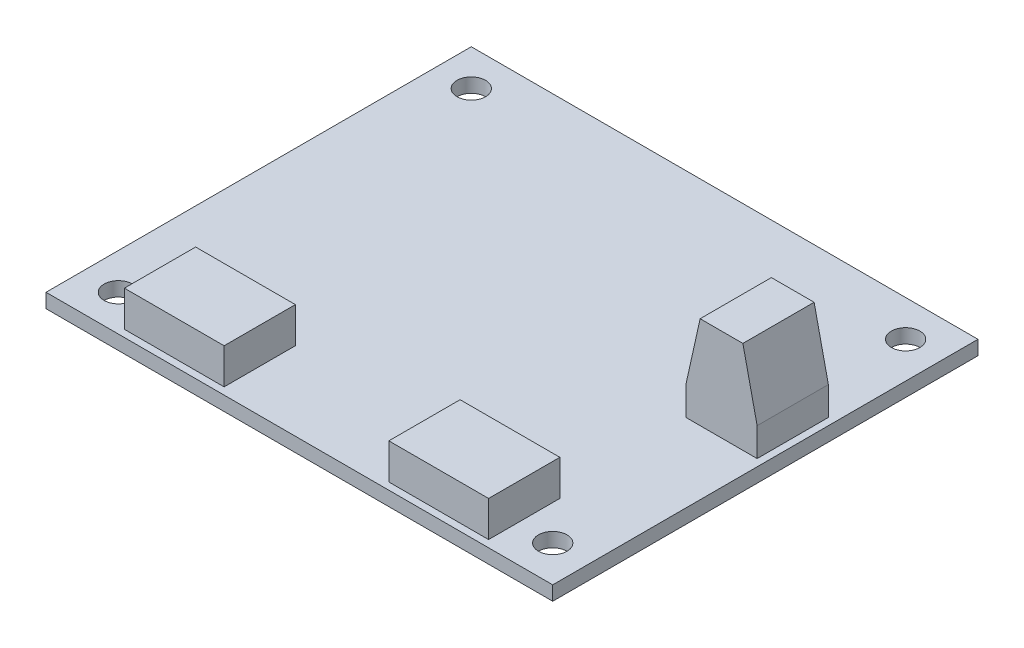
ISO-10303-21;
HEADER;
FILE_DESCRIPTION(('STEP AP214'),'2;1');
FILE_NAME('part.step','',(''),(''),'','','');
FILE_SCHEMA(('AUTOMOTIVE_DESIGN { 1 0 10303 214 1 1 1 1 }'));
ENDSEC;
DATA;
#1=APPLICATION_CONTEXT('core data for automotive mechanical design processes');
#2=APPLICATION_PROTOCOL_DEFINITION('international standard','automotive_design',2000,#1);
#3=PRODUCT_CONTEXT('',#1,'mechanical');
#4=PRODUCT('Part','Part','',(#3));
#5=PRODUCT_RELATED_PRODUCT_CATEGORY('part','',(#4));
#6=PRODUCT_DEFINITION_FORMATION('','',#4);
#7=PRODUCT_DEFINITION_CONTEXT('part definition',#1,'design');
#8=PRODUCT_DEFINITION('design','',#6,#7);
#9=PRODUCT_DEFINITION_SHAPE('','',#8);
#10=(LENGTH_UNIT() NAMED_UNIT(*) SI_UNIT(.MILLI.,.METRE.));
#11=(NAMED_UNIT(*) PLANE_ANGLE_UNIT() SI_UNIT($,.RADIAN.));
#12=(NAMED_UNIT(*) SI_UNIT($,.STERADIAN.) SOLID_ANGLE_UNIT());
#13=UNCERTAINTY_MEASURE_WITH_UNIT(LENGTH_MEASURE(1.E-05),#10,'distance_accuracy_value','');
#14=(GEOMETRIC_REPRESENTATION_CONTEXT(3) GLOBAL_UNCERTAINTY_ASSIGNED_CONTEXT((#13)) GLOBAL_UNIT_ASSIGNED_CONTEXT((#10,
#11,#12)) REPRESENTATION_CONTEXT('',''));
#15=CARTESIAN_POINT('',(0.,0.,0.));
#16=DIRECTION('',(0.,0.,1.));
#17=DIRECTION('',(1.,0.,0.));
#18=AXIS2_PLACEMENT_3D('',#15,#16,#17);
#19=CARTESIAN_POINT('',(-35.56,2.,29.845));
#20=DIRECTION('',(0.,1.,0.));
#21=DIRECTION('',(0.,0.,1.));
#22=AXIS2_PLACEMENT_3D('',#19,#20,#21);
#23=PLANE('',#22);
#24=DIRECTION('',(1.,0.,0.));
#25=VECTOR('',#24,1.);
#26=CARTESIAN_POINT('',(11.56,2.,28.845));
#27=LINE('',#26,#25);
#28=CARTESIAN_POINT('',(11.56,2.,28.845));
#29=VERTEX_POINT('',#28);
#30=CARTESIAN_POINT('',(25.56,2.,28.845));
#31=VERTEX_POINT('',#30);
#32=EDGE_CURVE('E212',#29,#31,#27,.T.);
#33=ORIENTED_EDGE('',*,*,#32,.F.);
#34=DIRECTION('',(0.,0.,1.));
#35=VECTOR('',#34,1.);
#36=CARTESIAN_POINT('',(11.56,2.,28.845));
#37=LINE('',#36,#35);
#38=CARTESIAN_POINT('',(11.56,2.,18.845));
#39=VERTEX_POINT('',#38);
#40=EDGE_CURVE('E198',#39,#29,#37,.T.);
#41=ORIENTED_EDGE('',*,*,#40,.F.);
#42=DIRECTION('',(-1.,0.,0.));
#43=VECTOR('',#42,1.);
#44=CARTESIAN_POINT('',(11.56,2.,18.845));
#45=LINE('',#44,#43);
#46=CARTESIAN_POINT('',(25.56,2.,18.845));
#47=VERTEX_POINT('',#46);
#48=EDGE_CURVE('E203',#47,#39,#45,.T.);
#49=ORIENTED_EDGE('',*,*,#48,.F.);
#50=DIRECTION('',(0.,0.,-1.));
#51=VECTOR('',#50,1.);
#52=CARTESIAN_POINT('',(25.56,2.,28.845));
#53=LINE('',#52,#51);
#54=EDGE_CURVE('E214',#31,#47,#53,.T.);
#55=ORIENTED_EDGE('',*,*,#54,.F.);
#56=EDGE_LOOP('',(#33,#41,#49,#55));
#57=FACE_BOUND('',#56,.T.);
#58=DIRECTION('',(0.,0.,1.));
#59=VECTOR('',#58,1.);
#60=CARTESIAN_POINT('',(-35.56,2.,-29.845));
#61=LINE('',#60,#59);
#62=CARTESIAN_POINT('',(-35.56,2.,-29.845));
#63=VERTEX_POINT('',#62);
#64=CARTESIAN_POINT('',(-35.56,2.,29.845));
#65=VERTEX_POINT('',#64);
#66=EDGE_CURVE('E281',#63,#65,#61,.T.);
#67=ORIENTED_EDGE('',*,*,#66,.T.);
#68=DIRECTION('',(1.,0.,0.));
#69=VECTOR('',#68,1.);
#70=CARTESIAN_POINT('',(-35.56,2.,29.845));
#71=LINE('',#70,#69);
#72=CARTESIAN_POINT('',(35.56,2.,29.845));
#73=VERTEX_POINT('',#72);
#74=EDGE_CURVE('E284',#65,#73,#71,.T.);
#75=ORIENTED_EDGE('',*,*,#74,.T.);
#76=DIRECTION('',(0.,0.,-1.));
#77=VECTOR('',#76,1.);
#78=CARTESIAN_POINT('',(35.56,2.,-29.845));
#79=LINE('',#78,#77);
#80=CARTESIAN_POINT('',(35.56,2.,-29.845));
#81=VERTEX_POINT('',#80);
#82=EDGE_CURVE('E287',#73,#81,#79,.T.);
#83=ORIENTED_EDGE('',*,*,#82,.T.);
#84=DIRECTION('',(-1.,0.,0.));
#85=VECTOR('',#84,1.);
#86=CARTESIAN_POINT('',(-35.56,2.,-29.845));
#87=LINE('',#86,#85);
#88=EDGE_CURVE('E289',#81,#63,#87,.T.);
#89=ORIENTED_EDGE('',*,*,#88,.T.);
#90=EDGE_LOOP('',(#67,#75,#83,#89));
#91=FACE_BOUND('',#90,.T.);
#92=CARTESIAN_POINT('',(-30.48,2.,-24.765));
#93=DIRECTION('',(0.,1.,0.));
#94=DIRECTION('',(0.,0.,1.));
#95=AXIS2_PLACEMENT_3D('',#92,#93,#94);
#96=CIRCLE('',#95,2.);
#97=CARTESIAN_POINT('',(-30.48,2.,-22.765));
#98=VERTEX_POINT('',#97);
#99=EDGE_CURVE('E272',#98,#98,#96,.T.);
#100=ORIENTED_EDGE('',*,*,#99,.F.);
#101=EDGE_LOOP('',(#100));
#102=FACE_BOUND('',#101,.T.);
#103=CARTESIAN_POINT('',(30.48,2.,-24.765));
#104=DIRECTION('',(0.,1.,0.));
#105=DIRECTION('',(0.,0.,1.));
#106=AXIS2_PLACEMENT_3D('',#103,#104,#105);
#107=CIRCLE('',#106,2.);
#108=CARTESIAN_POINT('',(30.48,2.,-22.765));
#109=VERTEX_POINT('',#108);
#110=EDGE_CURVE('E266',#109,#109,#107,.T.);
#111=ORIENTED_EDGE('',*,*,#110,.F.);
#112=EDGE_LOOP('',(#111));
#113=FACE_BOUND('',#112,.T.);
#114=CARTESIAN_POINT('',(30.48,2.,24.765));
#115=DIRECTION('',(0.,1.,0.));
#116=DIRECTION('',(0.,0.,1.));
#117=AXIS2_PLACEMENT_3D('',#114,#115,#116);
#118=CIRCLE('',#117,2.);
#119=CARTESIAN_POINT('',(30.48,2.,26.765));
#120=VERTEX_POINT('',#119);
#121=EDGE_CURVE('E260',#120,#120,#118,.T.);
#122=ORIENTED_EDGE('',*,*,#121,.F.);
#123=EDGE_LOOP('',(#122));
#124=FACE_BOUND('',#123,.T.);
#125=CARTESIAN_POINT('',(-30.48,2.,24.765));
#126=DIRECTION('',(0.,1.,0.));
#127=DIRECTION('',(0.,0.,1.));
#128=AXIS2_PLACEMENT_3D('',#125,#126,#127);
#129=CIRCLE('',#128,2.);
#130=CARTESIAN_POINT('',(-30.48,2.,26.765));
#131=VERTEX_POINT('',#130);
#132=EDGE_CURVE('E256',#131,#131,#129,.T.);
#133=ORIENTED_EDGE('',*,*,#132,.F.);
#134=EDGE_LOOP('',(#133));
#135=FACE_BOUND('',#134,.T.);
#136=DIRECTION('',(-1.,0.,0.));
#137=VECTOR('',#136,1.);
#138=CARTESIAN_POINT('',(-11.56,2.,18.845));
#139=LINE('',#138,#137);
#140=CARTESIAN_POINT('',(-11.56,2.,18.845));
#141=VERTEX_POINT('',#140);
#142=CARTESIAN_POINT('',(-25.56,2.,18.845));
#143=VERTEX_POINT('',#142);
#144=EDGE_CURVE('E241',#141,#143,#139,.T.);
#145=ORIENTED_EDGE('',*,*,#144,.F.);
#146=DIRECTION('',(0.,0.,-1.));
#147=VECTOR('',#146,1.);
#148=CARTESIAN_POINT('',(-11.56,2.,28.845));
#149=LINE('',#148,#147);
#150=CARTESIAN_POINT('',(-11.56,2.,28.845));
#151=VERTEX_POINT('',#150);
#152=EDGE_CURVE('E227',#151,#141,#149,.T.);
#153=ORIENTED_EDGE('',*,*,#152,.F.);
#154=DIRECTION('',(1.,0.,0.));
#155=VECTOR('',#154,1.);
#156=CARTESIAN_POINT('',(-11.56,2.,28.845));
#157=LINE('',#156,#155);
#158=CARTESIAN_POINT('',(-25.56,2.,28.845));
#159=VERTEX_POINT('',#158);
#160=EDGE_CURVE('E232',#159,#151,#157,.T.);
#161=ORIENTED_EDGE('',*,*,#160,.F.);
#162=DIRECTION('',(0.,0.,1.));
#163=VECTOR('',#162,1.);
#164=CARTESIAN_POINT('',(-25.56,2.,28.845));
#165=LINE('',#164,#163);
#166=EDGE_CURVE('E243',#143,#159,#165,.T.);
#167=ORIENTED_EDGE('',*,*,#166,.F.);
#168=EDGE_LOOP('',(#145,#153,#161,#167));
#169=FACE_BOUND('',#168,.T.);
#170=DIRECTION('',(1.,0.,0.));
#171=VECTOR('',#170,1.);
#172=CARTESIAN_POINT('',(24.56,2.,0.155000000000002));
#173=LINE('',#172,#171);
#174=CARTESIAN_POINT('',(24.56,2.,0.155000000000002));
#175=VERTEX_POINT('',#174);
#176=CARTESIAN_POINT('',(34.56,2.,0.155000000000002));
#177=VERTEX_POINT('',#176);
#178=EDGE_CURVE('E188',#175,#177,#173,.T.);
#179=ORIENTED_EDGE('',*,*,#178,.F.);
#180=DIRECTION('',(0.,0.,1.));
#181=VECTOR('',#180,1.);
#182=CARTESIAN_POINT('',(24.56,2.,-9.845));
#183=LINE('',#182,#181);
#184=CARTESIAN_POINT('',(24.56,2.,-9.845));
#185=VERTEX_POINT('',#184);
#186=EDGE_CURVE('E185',#185,#175,#183,.T.);
#187=ORIENTED_EDGE('',*,*,#186,.F.);
#188=DIRECTION('',(-1.,0.,0.));
#189=VECTOR('',#188,1.);
#190=CARTESIAN_POINT('',(24.56,2.,-9.845));
#191=LINE('',#190,#189);
#192=CARTESIAN_POINT('',(34.56,2.,-9.845));
#193=VERTEX_POINT('',#192);
#194=EDGE_CURVE('E174',#193,#185,#191,.T.);
#195=ORIENTED_EDGE('',*,*,#194,.F.);
#196=DIRECTION('',(0.,0.,-1.));
#197=VECTOR('',#196,1.);
#198=CARTESIAN_POINT('',(34.56,2.,-9.845));
#199=LINE('',#198,#197);
#200=EDGE_CURVE('E179',#177,#193,#199,.T.);
#201=ORIENTED_EDGE('',*,*,#200,.F.);
#202=EDGE_LOOP('',(#179,#187,#195,#201));
#203=FACE_BOUND('',#202,.T.);
#204=ADVANCED_FACE('F34',(#57,#91,#102,#113,#124,#135,#169,#203),#23,.T.);
#205=CARTESIAN_POINT('',(-35.56,2.,-29.845));
#206=DIRECTION('',(1.,0.,0.));
#207=DIRECTION('',(0.,0.,-1.));
#208=AXIS2_PLACEMENT_3D('',#205,#206,#207);
#209=PLANE('',#208);
#210=DIRECTION('',(0.,0.,1.));
#211=VECTOR('',#210,1.);
#212=CARTESIAN_POINT('',(-35.56,0.,-29.845));
#213=LINE('',#212,#211);
#214=CARTESIAN_POINT('',(-35.56,0.,-29.845));
#215=VERTEX_POINT('',#214);
#216=CARTESIAN_POINT('',(-35.56,0.,29.845));
#217=VERTEX_POINT('',#216);
#218=EDGE_CURVE('E278',#215,#217,#213,.T.);
#219=ORIENTED_EDGE('',*,*,#218,.T.);
#220=DIRECTION('',(0.,-1.,0.));
#221=VECTOR('',#220,1.);
#222=CARTESIAN_POINT('',(-35.56,2.,29.845));
#223=LINE('',#222,#221);
#224=EDGE_CURVE('E307',#65,#217,#223,.T.);
#225=ORIENTED_EDGE('',*,*,#224,.F.);
#226=ORIENTED_EDGE('',*,*,#66,.F.);
#227=DIRECTION('',(0.,-1.,0.));
#228=VECTOR('',#227,1.);
#229=CARTESIAN_POINT('',(-35.56,2.,-29.845));
#230=LINE('',#229,#228);
#231=EDGE_CURVE('E291',#63,#215,#230,.T.);
#232=ORIENTED_EDGE('',*,*,#231,.T.);
#233=EDGE_LOOP('',(#219,#225,#226,#232));
#234=FACE_BOUND('',#233,.T.);
#235=ADVANCED_FACE('F36',(#234),#209,.F.);
#236=CARTESIAN_POINT('',(-35.56,2.,29.845));
#237=DIRECTION('',(0.,0.,-1.));
#238=DIRECTION('',(-1.,0.,0.));
#239=AXIS2_PLACEMENT_3D('',#236,#237,#238);
#240=PLANE('',#239);
#241=DIRECTION('',(1.,0.,0.));
#242=VECTOR('',#241,1.);
#243=CARTESIAN_POINT('',(-35.56,0.,29.845));
#244=LINE('',#243,#242);
#245=CARTESIAN_POINT('',(35.56,0.,29.845));
#246=VERTEX_POINT('',#245);
#247=EDGE_CURVE('E294',#217,#246,#244,.T.);
#248=ORIENTED_EDGE('',*,*,#247,.T.);
#249=DIRECTION('',(0.,-1.,0.));
#250=VECTOR('',#249,1.);
#251=CARTESIAN_POINT('',(35.56,2.,29.845));
#252=LINE('',#251,#250);
#253=EDGE_CURVE('E304',#73,#246,#252,.T.);
#254=ORIENTED_EDGE('',*,*,#253,.F.);
#255=ORIENTED_EDGE('',*,*,#74,.F.);
#256=ORIENTED_EDGE('',*,*,#224,.T.);
#257=EDGE_LOOP('',(#248,#254,#255,#256));
#258=FACE_BOUND('',#257,.T.);
#259=ADVANCED_FACE('F347',(#258),#240,.F.);
#260=CARTESIAN_POINT('',(35.56,2.,-29.845));
#261=DIRECTION('',(-1.,0.,0.));
#262=DIRECTION('',(0.,0.,1.));
#263=AXIS2_PLACEMENT_3D('',#260,#261,#262);
#264=PLANE('',#263);
#265=DIRECTION('',(0.,0.,-1.));
#266=VECTOR('',#265,1.);
#267=CARTESIAN_POINT('',(35.56,0.,-29.845));
#268=LINE('',#267,#266);
#269=CARTESIAN_POINT('',(35.56,0.,-29.845));
#270=VERTEX_POINT('',#269);
#271=EDGE_CURVE('E296',#246,#270,#268,.T.);
#272=ORIENTED_EDGE('',*,*,#271,.T.);
#273=DIRECTION('',(0.,-1.,0.));
#274=VECTOR('',#273,1.);
#275=CARTESIAN_POINT('',(35.56,2.,-29.845));
#276=LINE('',#275,#274);
#277=EDGE_CURVE('E301',#81,#270,#276,.T.);
#278=ORIENTED_EDGE('',*,*,#277,.F.);
#279=ORIENTED_EDGE('',*,*,#82,.F.);
#280=ORIENTED_EDGE('',*,*,#253,.T.);
#281=EDGE_LOOP('',(#272,#278,#279,#280));
#282=FACE_BOUND('',#281,.T.);
#283=ADVANCED_FACE('F362',(#282),#264,.F.);
#284=CARTESIAN_POINT('',(-35.56,2.,-29.845));
#285=DIRECTION('',(0.,0.,1.));
#286=DIRECTION('',(1.,0.,0.));
#287=AXIS2_PLACEMENT_3D('',#284,#285,#286);
#288=PLANE('',#287);
#289=DIRECTION('',(-1.,0.,0.));
#290=VECTOR('',#289,1.);
#291=CARTESIAN_POINT('',(-35.56,0.,-29.845));
#292=LINE('',#291,#290);
#293=EDGE_CURVE('E285',#270,#215,#292,.T.);
#294=ORIENTED_EDGE('',*,*,#293,.T.);
#295=ORIENTED_EDGE('',*,*,#231,.F.);
#296=ORIENTED_EDGE('',*,*,#88,.F.);
#297=ORIENTED_EDGE('',*,*,#277,.T.);
#298=EDGE_LOOP('',(#294,#295,#296,#297));
#299=FACE_BOUND('',#298,.T.);
#300=ADVANCED_FACE('F358',(#299),#288,.F.);
#301=CARTESIAN_POINT('',(-35.56,0.,29.845));
#302=DIRECTION('',(0.,1.,0.));
#303=DIRECTION('',(0.,0.,1.));
#304=AXIS2_PLACEMENT_3D('',#301,#302,#303);
#305=PLANE('',#304);
#306=CARTESIAN_POINT('',(-30.48,0.,24.765));
#307=DIRECTION('',(0.,1.,0.));
#308=DIRECTION('',(0.,0.,1.));
#309=AXIS2_PLACEMENT_3D('',#306,#307,#308);
#310=CIRCLE('',#309,2.);
#311=CARTESIAN_POINT('',(-30.48,0.,26.765));
#312=VERTEX_POINT('',#311);
#313=EDGE_CURVE('E257',#312,#312,#310,.T.);
#314=ORIENTED_EDGE('',*,*,#313,.T.);
#315=EDGE_LOOP('',(#314));
#316=FACE_BOUND('',#315,.T.);
#317=CARTESIAN_POINT('',(30.48,0.,24.765));
#318=DIRECTION('',(0.,1.,0.));
#319=DIRECTION('',(0.,0.,1.));
#320=AXIS2_PLACEMENT_3D('',#317,#318,#319);
#321=CIRCLE('',#320,2.);
#322=CARTESIAN_POINT('',(30.48,0.,26.765));
#323=VERTEX_POINT('',#322);
#324=EDGE_CURVE('E263',#323,#323,#321,.T.);
#325=ORIENTED_EDGE('',*,*,#324,.T.);
#326=EDGE_LOOP('',(#325));
#327=FACE_BOUND('',#326,.T.);
#328=CARTESIAN_POINT('',(30.48,0.,-24.765));
#329=DIRECTION('',(0.,1.,0.));
#330=DIRECTION('',(0.,0.,1.));
#331=AXIS2_PLACEMENT_3D('',#328,#329,#330);
#332=CIRCLE('',#331,2.);
#333=CARTESIAN_POINT('',(30.48,0.,-22.765));
#334=VERTEX_POINT('',#333);
#335=EDGE_CURVE('E269',#334,#334,#332,.T.);
#336=ORIENTED_EDGE('',*,*,#335,.T.);
#337=EDGE_LOOP('',(#336));
#338=FACE_BOUND('',#337,.T.);
#339=CARTESIAN_POINT('',(-30.48,0.,-24.765));
#340=DIRECTION('',(0.,1.,0.));
#341=DIRECTION('',(0.,0.,1.));
#342=AXIS2_PLACEMENT_3D('',#339,#340,#341);
#343=CIRCLE('',#342,2.);
#344=CARTESIAN_POINT('',(-30.48,0.,-22.765));
#345=VERTEX_POINT('',#344);
#346=EDGE_CURVE('E275',#345,#345,#343,.T.);
#347=ORIENTED_EDGE('',*,*,#346,.T.);
#348=EDGE_LOOP('',(#347));
#349=FACE_BOUND('',#348,.T.);
#350=ORIENTED_EDGE('',*,*,#218,.F.);
#351=ORIENTED_EDGE('',*,*,#293,.F.);
#352=ORIENTED_EDGE('',*,*,#271,.F.);
#353=ORIENTED_EDGE('',*,*,#247,.F.);
#354=EDGE_LOOP('',(#350,#351,#352,#353));
#355=FACE_BOUND('',#354,.T.);
#356=ADVANCED_FACE('F355',(#316,#327,#338,#349,#355),#305,.F.);
#357=CARTESIAN_POINT('',(-30.48,0.,-24.765));
#358=DIRECTION('',(0.,1.,0.));
#359=DIRECTION('',(0.,0.,1.));
#360=AXIS2_PLACEMENT_3D('',#357,#358,#359);
#361=CYLINDRICAL_SURFACE('',#360,2.);
#362=ORIENTED_EDGE('',*,*,#346,.F.);
#363=EDGE_LOOP('',(#362));
#364=FACE_BOUND('',#363,.T.);
#365=ORIENTED_EDGE('',*,*,#99,.T.);
#366=EDGE_LOOP('',(#365));
#367=FACE_BOUND('',#366,.T.);
#368=ADVANCED_FACE('F353',(#364,#367),#361,.F.);
#369=CARTESIAN_POINT('',(30.48,0.,-24.765));
#370=DIRECTION('',(0.,1.,0.));
#371=DIRECTION('',(0.,0.,1.));
#372=AXIS2_PLACEMENT_3D('',#369,#370,#371);
#373=CYLINDRICAL_SURFACE('',#372,2.);
#374=ORIENTED_EDGE('',*,*,#335,.F.);
#375=EDGE_LOOP('',(#374));
#376=FACE_BOUND('',#375,.T.);
#377=ORIENTED_EDGE('',*,*,#110,.T.);
#378=EDGE_LOOP('',(#377));
#379=FACE_BOUND('',#378,.T.);
#380=ADVANCED_FACE('F432',(#376,#379),#373,.F.);
#381=CARTESIAN_POINT('',(30.48,0.,24.765));
#382=DIRECTION('',(0.,1.,0.));
#383=DIRECTION('',(0.,0.,1.));
#384=AXIS2_PLACEMENT_3D('',#381,#382,#383);
#385=CYLINDRICAL_SURFACE('',#384,2.);
#386=ORIENTED_EDGE('',*,*,#324,.F.);
#387=EDGE_LOOP('',(#386));
#388=FACE_BOUND('',#387,.T.);
#389=ORIENTED_EDGE('',*,*,#121,.T.);
#390=EDGE_LOOP('',(#389));
#391=FACE_BOUND('',#390,.T.);
#392=ADVANCED_FACE('F429',(#388,#391),#385,.F.);
#393=CARTESIAN_POINT('',(-30.48,0.,24.765));
#394=DIRECTION('',(0.,1.,0.));
#395=DIRECTION('',(0.,0.,1.));
#396=AXIS2_PLACEMENT_3D('',#393,#394,#395);
#397=CYLINDRICAL_SURFACE('',#396,2.);
#398=ORIENTED_EDGE('',*,*,#313,.F.);
#399=EDGE_LOOP('',(#398));
#400=FACE_BOUND('',#399,.T.);
#401=ORIENTED_EDGE('',*,*,#132,.T.);
#402=EDGE_LOOP('',(#401));
#403=FACE_BOUND('',#402,.T.);
#404=ADVANCED_FACE('F426',(#400,#403),#397,.F.);
#405=CARTESIAN_POINT('',(-11.56,7.,28.845));
#406=DIRECTION('',(-1.,0.,0.));
#407=DIRECTION('',(0.,0.,1.));
#408=AXIS2_PLACEMENT_3D('',#405,#406,#407);
#409=PLANE('',#408);
#410=ORIENTED_EDGE('',*,*,#152,.T.);
#411=DIRECTION('',(0.,-1.,0.));
#412=VECTOR('',#411,1.);
#413=CARTESIAN_POINT('',(-11.56,7.,18.845));
#414=LINE('',#413,#412);
#415=CARTESIAN_POINT('',(-11.56,7.,18.845));
#416=VERTEX_POINT('',#415);
#417=EDGE_CURVE('E254',#416,#141,#414,.T.);
#418=ORIENTED_EDGE('',*,*,#417,.F.);
#419=DIRECTION('',(0.,0.,-1.));
#420=VECTOR('',#419,1.);
#421=CARTESIAN_POINT('',(-11.56,7.,28.845));
#422=LINE('',#421,#420);
#423=CARTESIAN_POINT('',(-11.56,7.,28.845));
#424=VERTEX_POINT('',#423);
#425=EDGE_CURVE('E228',#424,#416,#422,.T.);
#426=ORIENTED_EDGE('',*,*,#425,.F.);
#427=DIRECTION('',(0.,-1.,0.));
#428=VECTOR('',#427,1.);
#429=CARTESIAN_POINT('',(-11.56,7.,28.845));
#430=LINE('',#429,#428);
#431=EDGE_CURVE('E238',#424,#151,#430,.T.);
#432=ORIENTED_EDGE('',*,*,#431,.T.);
#433=EDGE_LOOP('',(#410,#418,#426,#432));
#434=FACE_BOUND('',#433,.T.);
#435=ADVANCED_FACE('F408',(#434),#409,.F.);
#436=CARTESIAN_POINT('',(-11.56,7.,18.845));
#437=DIRECTION('',(0.,0.,1.));
#438=DIRECTION('',(1.,0.,0.));
#439=AXIS2_PLACEMENT_3D('',#436,#437,#438);
#440=PLANE('',#439);
#441=ORIENTED_EDGE('',*,*,#144,.T.);
#442=DIRECTION('',(0.,-1.,0.));
#443=VECTOR('',#442,1.);
#444=CARTESIAN_POINT('',(-25.56,7.,18.845));
#445=LINE('',#444,#443);
#446=CARTESIAN_POINT('',(-25.56,7.,18.845));
#447=VERTEX_POINT('',#446);
#448=EDGE_CURVE('E251',#447,#143,#445,.T.);
#449=ORIENTED_EDGE('',*,*,#448,.F.);
#450=DIRECTION('',(-1.,0.,0.));
#451=VECTOR('',#450,1.);
#452=CARTESIAN_POINT('',(-11.56,7.,18.845));
#453=LINE('',#452,#451);
#454=EDGE_CURVE('E231',#416,#447,#453,.T.);
#455=ORIENTED_EDGE('',*,*,#454,.F.);
#456=ORIENTED_EDGE('',*,*,#417,.T.);
#457=EDGE_LOOP('',(#441,#449,#455,#456));
#458=FACE_BOUND('',#457,.T.);
#459=ADVANCED_FACE('F396',(#458),#440,.F.);
#460=CARTESIAN_POINT('',(-25.56,7.,28.845));
#461=DIRECTION('',(1.,0.,0.));
#462=DIRECTION('',(0.,0.,-1.));
#463=AXIS2_PLACEMENT_3D('',#460,#461,#462);
#464=PLANE('',#463);
#465=ORIENTED_EDGE('',*,*,#166,.T.);
#466=DIRECTION('',(0.,-1.,0.));
#467=VECTOR('',#466,1.);
#468=CARTESIAN_POINT('',(-25.56,7.,28.845));
#469=LINE('',#468,#467);
#470=CARTESIAN_POINT('',(-25.56,7.,28.845));
#471=VERTEX_POINT('',#470);
#472=EDGE_CURVE('E249',#471,#159,#469,.T.);
#473=ORIENTED_EDGE('',*,*,#472,.F.);
#474=DIRECTION('',(0.,0.,1.));
#475=VECTOR('',#474,1.);
#476=CARTESIAN_POINT('',(-25.56,7.,28.845));
#477=LINE('',#476,#475);
#478=EDGE_CURVE('E234',#447,#471,#477,.T.);
#479=ORIENTED_EDGE('',*,*,#478,.F.);
#480=ORIENTED_EDGE('',*,*,#448,.T.);
#481=EDGE_LOOP('',(#465,#473,#479,#480));
#482=FACE_BOUND('',#481,.T.);
#483=ADVANCED_FACE('F400',(#482),#464,.F.);
#484=CARTESIAN_POINT('',(-11.56,7.,28.845));
#485=DIRECTION('',(0.,0.,-1.));
#486=DIRECTION('',(-1.,0.,0.));
#487=AXIS2_PLACEMENT_3D('',#484,#485,#486);
#488=PLANE('',#487);
#489=ORIENTED_EDGE('',*,*,#160,.T.);
#490=ORIENTED_EDGE('',*,*,#431,.F.);
#491=DIRECTION('',(1.,0.,0.));
#492=VECTOR('',#491,1.);
#493=CARTESIAN_POINT('',(-11.56,7.,28.845));
#494=LINE('',#493,#492);
#495=EDGE_CURVE('E236',#471,#424,#494,.T.);
#496=ORIENTED_EDGE('',*,*,#495,.F.);
#497=ORIENTED_EDGE('',*,*,#472,.T.);
#498=EDGE_LOOP('',(#489,#490,#496,#497));
#499=FACE_BOUND('',#498,.T.);
#500=ADVANCED_FACE('F410',(#499),#488,.F.);
#501=CARTESIAN_POINT('',(-11.56,7.,18.845));
#502=DIRECTION('',(0.,1.,0.));
#503=DIRECTION('',(0.,0.,1.));
#504=AXIS2_PLACEMENT_3D('',#501,#502,#503);
#505=PLANE('',#504);
#506=ORIENTED_EDGE('',*,*,#425,.T.);
#507=ORIENTED_EDGE('',*,*,#454,.T.);
#508=ORIENTED_EDGE('',*,*,#478,.T.);
#509=ORIENTED_EDGE('',*,*,#495,.T.);
#510=EDGE_LOOP('',(#506,#507,#508,#509));
#511=FACE_BOUND('',#510,.T.);
#512=ADVANCED_FACE('F404',(#511),#505,.T.);
#513=CARTESIAN_POINT('',(11.56,7.,28.845));
#514=DIRECTION('',(1.,0.,0.));
#515=DIRECTION('',(0.,0.,-1.));
#516=AXIS2_PLACEMENT_3D('',#513,#514,#515);
#517=PLANE('',#516);
#518=ORIENTED_EDGE('',*,*,#40,.T.);
#519=DIRECTION('',(0.,-1.,0.));
#520=VECTOR('',#519,1.);
#521=CARTESIAN_POINT('',(11.56,7.,28.845));
#522=LINE('',#521,#520);
#523=CARTESIAN_POINT('',(11.56,7.,28.845));
#524=VERTEX_POINT('',#523);
#525=EDGE_CURVE('E225',#524,#29,#522,.T.);
#526=ORIENTED_EDGE('',*,*,#525,.F.);
#527=DIRECTION('',(0.,0.,1.));
#528=VECTOR('',#527,1.);
#529=CARTESIAN_POINT('',(11.56,7.,28.845));
#530=LINE('',#529,#528);
#531=CARTESIAN_POINT('',(11.56,7.,18.845));
#532=VERTEX_POINT('',#531);
#533=EDGE_CURVE('E199',#532,#524,#530,.T.);
#534=ORIENTED_EDGE('',*,*,#533,.F.);
#535=DIRECTION('',(0.,-1.,0.));
#536=VECTOR('',#535,1.);
#537=CARTESIAN_POINT('',(11.56,7.,18.845));
#538=LINE('',#537,#536);
#539=EDGE_CURVE('E209',#532,#39,#538,.T.);
#540=ORIENTED_EDGE('',*,*,#539,.T.);
#541=EDGE_LOOP('',(#518,#526,#534,#540));
#542=FACE_BOUND('',#541,.T.);
#543=ADVANCED_FACE('F417',(#542),#517,.F.);
#544=CARTESIAN_POINT('',(11.56,7.,28.845));
#545=DIRECTION('',(0.,0.,-1.));
#546=DIRECTION('',(-1.,0.,0.));
#547=AXIS2_PLACEMENT_3D('',#544,#545,#546);
#548=PLANE('',#547);
#549=ORIENTED_EDGE('',*,*,#32,.T.);
#550=DIRECTION('',(0.,-1.,0.));
#551=VECTOR('',#550,1.);
#552=CARTESIAN_POINT('',(25.56,7.,28.845));
#553=LINE('',#552,#551);
#554=CARTESIAN_POINT('',(25.56,7.,28.845));
#555=VERTEX_POINT('',#554);
#556=EDGE_CURVE('E222',#555,#31,#553,.T.);
#557=ORIENTED_EDGE('',*,*,#556,.F.);
#558=DIRECTION('',(1.,0.,0.));
#559=VECTOR('',#558,1.);
#560=CARTESIAN_POINT('',(11.56,7.,28.845));
#561=LINE('',#560,#559);
#562=EDGE_CURVE('E202',#524,#555,#561,.T.);
#563=ORIENTED_EDGE('',*,*,#562,.F.);
#564=ORIENTED_EDGE('',*,*,#525,.T.);
#565=EDGE_LOOP('',(#549,#557,#563,#564));
#566=FACE_BOUND('',#565,.T.);
#567=ADVANCED_FACE('F531',(#566),#548,.F.);
#568=CARTESIAN_POINT('',(25.56,7.,28.845));
#569=DIRECTION('',(-1.,0.,0.));
#570=DIRECTION('',(0.,0.,1.));
#571=AXIS2_PLACEMENT_3D('',#568,#569,#570);
#572=PLANE('',#571);
#573=ORIENTED_EDGE('',*,*,#54,.T.);
#574=DIRECTION('',(0.,-1.,0.));
#575=VECTOR('',#574,1.);
#576=CARTESIAN_POINT('',(25.56,7.,18.845));
#577=LINE('',#576,#575);
#578=CARTESIAN_POINT('',(25.56,7.,18.845));
#579=VERTEX_POINT('',#578);
#580=EDGE_CURVE('E220',#579,#47,#577,.T.);
#581=ORIENTED_EDGE('',*,*,#580,.F.);
#582=DIRECTION('',(0.,0.,-1.));
#583=VECTOR('',#582,1.);
#584=CARTESIAN_POINT('',(25.56,7.,28.845));
#585=LINE('',#584,#583);
#586=EDGE_CURVE('E205',#555,#579,#585,.T.);
#587=ORIENTED_EDGE('',*,*,#586,.F.);
#588=ORIENTED_EDGE('',*,*,#556,.T.);
#589=EDGE_LOOP('',(#573,#581,#587,#588));
#590=FACE_BOUND('',#589,.T.);
#591=ADVANCED_FACE('F539',(#590),#572,.F.);
#592=CARTESIAN_POINT('',(11.56,7.,18.845));
#593=DIRECTION('',(0.,0.,1.));
#594=DIRECTION('',(1.,0.,0.));
#595=AXIS2_PLACEMENT_3D('',#592,#593,#594);
#596=PLANE('',#595);
#597=ORIENTED_EDGE('',*,*,#48,.T.);
#598=ORIENTED_EDGE('',*,*,#539,.F.);
#599=DIRECTION('',(-1.,0.,0.));
#600=VECTOR('',#599,1.);
#601=CARTESIAN_POINT('',(11.56,7.,18.845));
#602=LINE('',#601,#600);
#603=EDGE_CURVE('E207',#579,#532,#602,.T.);
#604=ORIENTED_EDGE('',*,*,#603,.F.);
#605=ORIENTED_EDGE('',*,*,#580,.T.);
#606=EDGE_LOOP('',(#597,#598,#604,#605));
#607=FACE_BOUND('',#606,.T.);
#608=ADVANCED_FACE('F338',(#607),#596,.F.);
#609=CARTESIAN_POINT('',(11.56,7.,18.845));
#610=DIRECTION('',(0.,-1.,0.));
#611=DIRECTION('',(0.,0.,-1.));
#612=AXIS2_PLACEMENT_3D('',#609,#610,#611);
#613=PLANE('',#612);
#614=ORIENTED_EDGE('',*,*,#533,.T.);
#615=ORIENTED_EDGE('',*,*,#562,.T.);
#616=ORIENTED_EDGE('',*,*,#586,.T.);
#617=ORIENTED_EDGE('',*,*,#603,.T.);
#618=EDGE_LOOP('',(#614,#615,#616,#617));
#619=FACE_BOUND('',#618,.T.);
#620=ADVANCED_FACE('F331',(#619),#613,.F.);
#621=CARTESIAN_POINT('',(24.56,15.,-9.845));
#622=DIRECTION('',(1.,0.,0.));
#623=DIRECTION('',(0.,0.,-1.));
#624=AXIS2_PLACEMENT_3D('',#621,#622,#623);
#625=PLANE('',#624);
#626=DIRECTION('',(0.,-1.,0.));
#627=VECTOR('',#626,1.);
#628=CARTESIAN_POINT('',(24.56,15.,0.155000000000002));
#629=LINE('',#628,#627);
#630=CARTESIAN_POINT('',(24.56,6.,0.155000000000002));
#631=VERTEX_POINT('',#630);
#632=EDGE_CURVE('E196',#631,#175,#629,.T.);
#633=ORIENTED_EDGE('',*,*,#632,.F.);
#634=DIRECTION('',(0.,0.,1.));
#635=VECTOR('',#634,1.);
#636=CARTESIAN_POINT('',(24.56,6.,-29.845));
#637=LINE('',#636,#635);
#638=CARTESIAN_POINT('',(24.56,6.,-9.84500000000001));
#639=VERTEX_POINT('',#638);
#640=EDGE_CURVE('E315',#639,#631,#637,.T.);
#641=ORIENTED_EDGE('',*,*,#640,.F.);
#642=DIRECTION('',(0.,-1.,0.));
#643=VECTOR('',#642,1.);
#644=CARTESIAN_POINT('',(24.56,15.,-9.845));
#645=LINE('',#644,#643);
#646=EDGE_CURVE('E176',#639,#185,#645,.T.);
#647=ORIENTED_EDGE('',*,*,#646,.T.);
#648=ORIENTED_EDGE('',*,*,#186,.T.);
#649=EDGE_LOOP('',(#633,#641,#647,#648));
#650=FACE_BOUND('',#649,.T.);
#651=ADVANCED_FACE('F329',(#650),#625,.F.);
#652=CARTESIAN_POINT('',(24.56,15.,0.155000000000002));
#653=DIRECTION('',(0.,0.,-1.));
#654=DIRECTION('',(-1.,0.,0.));
#655=AXIS2_PLACEMENT_3D('',#652,#653,#654);
#656=PLANE('',#655);
#657=DIRECTION('',(0.,-1.,0.));
#658=VECTOR('',#657,1.);
#659=CARTESIAN_POINT('',(34.56,15.,0.155000000000002));
#660=LINE('',#659,#658);
#661=CARTESIAN_POINT('',(34.56,6.,0.155000000000002));
#662=VERTEX_POINT('',#661);
#663=EDGE_CURVE('E169',#662,#177,#660,.T.);
#664=ORIENTED_EDGE('',*,*,#663,.F.);
#665=DIRECTION('',(0.216930457818656,-0.976187060183953,0.));
#666=VECTOR('',#665,1.);
#667=CARTESIAN_POINT('',(34.56,6.,0.155000000000002));
#668=LINE('',#667,#666);
#669=CARTESIAN_POINT('',(32.56,15.,0.155000000000002));
#670=VERTEX_POINT('',#669);
#671=EDGE_CURVE('E158',#670,#662,#668,.T.);
#672=ORIENTED_EDGE('',*,*,#671,.F.);
#673=DIRECTION('',(1.,0.,0.));
#674=VECTOR('',#673,1.);
#675=CARTESIAN_POINT('',(24.56,15.,0.155000000000002));
#676=LINE('',#675,#674);
#677=CARTESIAN_POINT('',(26.56,15.,0.155000000000002));
#678=VERTEX_POINT('',#677);
#679=EDGE_CURVE('E167',#678,#670,#676,.T.);
#680=ORIENTED_EDGE('',*,*,#679,.F.);
#681=DIRECTION('',(0.216930457818656,0.976187060183953,0.));
#682=VECTOR('',#681,1.);
#683=CARTESIAN_POINT('',(26.56,15.,0.155000000000002));
#684=LINE('',#683,#682);
#685=EDGE_CURVE('E56',#631,#678,#684,.T.);
#686=ORIENTED_EDGE('',*,*,#685,.F.);
#687=ORIENTED_EDGE('',*,*,#632,.T.);
#688=ORIENTED_EDGE('',*,*,#178,.T.);
#689=EDGE_LOOP('',(#664,#672,#680,#686,#687,#688));
#690=FACE_BOUND('',#689,.T.);
#691=ADVANCED_FACE('F166',(#690),#656,.F.);
#692=CARTESIAN_POINT('',(34.56,15.,-9.845));
#693=DIRECTION('',(-1.,0.,0.));
#694=DIRECTION('',(0.,0.,1.));
#695=AXIS2_PLACEMENT_3D('',#692,#693,#694);
#696=PLANE('',#695);
#697=DIRECTION('',(0.,-1.,0.));
#698=VECTOR('',#697,1.);
#699=CARTESIAN_POINT('',(34.56,15.,-9.845));
#700=LINE('',#699,#698);
#701=CARTESIAN_POINT('',(34.56,6.,-9.84500000000001));
#702=VERTEX_POINT('',#701);
#703=EDGE_CURVE('E193',#702,#193,#700,.T.);
#704=ORIENTED_EDGE('',*,*,#703,.F.);
#705=DIRECTION('',(0.,0.,1.));
#706=VECTOR('',#705,1.);
#707=CARTESIAN_POINT('',(34.56,6.,-29.845));
#708=LINE('',#707,#706);
#709=EDGE_CURVE('E170',#702,#662,#708,.T.);
#710=ORIENTED_EDGE('',*,*,#709,.T.);
#711=ORIENTED_EDGE('',*,*,#663,.T.);
#712=ORIENTED_EDGE('',*,*,#200,.T.);
#713=EDGE_LOOP('',(#704,#710,#711,#712));
#714=FACE_BOUND('',#713,.T.);
#715=ADVANCED_FACE('F321',(#714),#696,.F.);
#716=CARTESIAN_POINT('',(24.56,15.,-9.845));
#717=DIRECTION('',(0.,0.,1.));
#718=DIRECTION('',(1.,0.,0.));
#719=AXIS2_PLACEMENT_3D('',#716,#717,#718);
#720=PLANE('',#719);
#721=DIRECTION('',(-1.,0.,0.));
#722=VECTOR('',#721,1.);
#723=CARTESIAN_POINT('',(24.56,15.,-9.845));
#724=LINE('',#723,#722);
#725=CARTESIAN_POINT('',(32.56,15.,-9.845));
#726=VERTEX_POINT('',#725);
#727=CARTESIAN_POINT('',(26.56,15.,-9.84500000000001));
#728=VERTEX_POINT('',#727);
#729=EDGE_CURVE('E173',#726,#728,#724,.T.);
#730=ORIENTED_EDGE('',*,*,#729,.F.);
#731=DIRECTION('',(0.216930457818656,-0.976187060183953,0.));
#732=VECTOR('',#731,1.);
#733=CARTESIAN_POINT('',(32.1835294117647,16.6941176470588,-9.845));
#734=LINE('',#733,#732);
#735=EDGE_CURVE('E48',#726,#702,#734,.T.);
#736=ORIENTED_EDGE('',*,*,#735,.T.);
#737=ORIENTED_EDGE('',*,*,#703,.T.);
#738=ORIENTED_EDGE('',*,*,#194,.T.);
#739=ORIENTED_EDGE('',*,*,#646,.F.);
#740=DIRECTION('',(0.216930457818656,0.976187060183953,0.));
#741=VECTOR('',#740,1.);
#742=CARTESIAN_POINT('',(26.4658823529412,14.5764705882353,-9.845));
#743=LINE('',#742,#741);
#744=EDGE_CURVE('E182',#639,#728,#743,.T.);
#745=ORIENTED_EDGE('',*,*,#744,.T.);
#746=EDGE_LOOP('',(#730,#736,#737,#738,#739,#745));
#747=FACE_BOUND('',#746,.T.);
#748=ADVANCED_FACE('F314',(#747),#720,.F.);
#749=CARTESIAN_POINT('',(24.56,15.,0.155000000000002));
#750=DIRECTION('',(0.,1.,0.));
#751=DIRECTION('',(0.,0.,1.));
#752=AXIS2_PLACEMENT_3D('',#749,#750,#751);
#753=PLANE('',#752);
#754=DIRECTION('',(0.,0.,1.));
#755=VECTOR('',#754,1.);
#756=CARTESIAN_POINT('',(32.56,15.,0.155000000000002));
#757=LINE('',#756,#755);
#758=EDGE_CURVE('E11',#726,#670,#757,.T.);
#759=ORIENTED_EDGE('',*,*,#758,.F.);
#760=ORIENTED_EDGE('',*,*,#729,.T.);
#761=DIRECTION('',(0.,0.,-1.));
#762=VECTOR('',#761,1.);
#763=CARTESIAN_POINT('',(26.56,15.,0.155000000000002));
#764=LINE('',#763,#762);
#765=EDGE_CURVE('E42',#678,#728,#764,.T.);
#766=ORIENTED_EDGE('',*,*,#765,.F.);
#767=ORIENTED_EDGE('',*,*,#679,.T.);
#768=EDGE_LOOP('',(#759,#760,#766,#767));
#769=FACE_BOUND('',#768,.T.);
#770=ADVANCED_FACE('F172',(#769),#753,.T.);
#771=CARTESIAN_POINT('',(26.56,15.,-29.845));
#772=DIRECTION('',(0.976187060183953,-0.216930457818656,0.));
#773=DIRECTION('',(0.216930457818656,0.976187060183953,0.));
#774=AXIS2_PLACEMENT_3D('',#771,#772,#773);
#775=PLANE('',#774);
#776=ORIENTED_EDGE('',*,*,#640,.T.);
#777=ORIENTED_EDGE('',*,*,#685,.T.);
#778=ORIENTED_EDGE('',*,*,#765,.T.);
#779=ORIENTED_EDGE('',*,*,#744,.F.);
#780=EDGE_LOOP('',(#776,#777,#778,#779));
#781=FACE_BOUND('',#780,.T.);
#782=ADVANCED_FACE('F310',(#781),#775,.F.);
#783=CARTESIAN_POINT('',(34.56,6.,-29.845));
#784=DIRECTION('',(-0.976187060183953,-0.216930457818656,0.));
#785=DIRECTION('',(0.216930457818656,-0.976187060183953,0.));
#786=AXIS2_PLACEMENT_3D('',#783,#784,#785);
#787=PLANE('',#786);
#788=ORIENTED_EDGE('',*,*,#758,.T.);
#789=ORIENTED_EDGE('',*,*,#671,.T.);
#790=ORIENTED_EDGE('',*,*,#709,.F.);
#791=ORIENTED_EDGE('',*,*,#735,.F.);
#792=EDGE_LOOP('',(#788,#789,#790,#791));
#793=FACE_BOUND('',#792,.T.);
#794=ADVANCED_FACE('F157',(#793),#787,.F.);
#795=CLOSED_SHELL('',(#204,#235,#259,#283,#300,#356,#368,#380,#392,#404,#435,#459,#483,#500,
#512,#543,#567,#591,#608,#620,#651,#691,#715,#748,#770,#782,#794));
#796=MANIFOLD_SOLID_BREP('B2',#795);
#797=ADVANCED_BREP_SHAPE_REPRESENTATION('',(#18,#796),#14);
#798=SHAPE_DEFINITION_REPRESENTATION(#9,#797);
ENDSEC;
END-ISO-10303-21;
